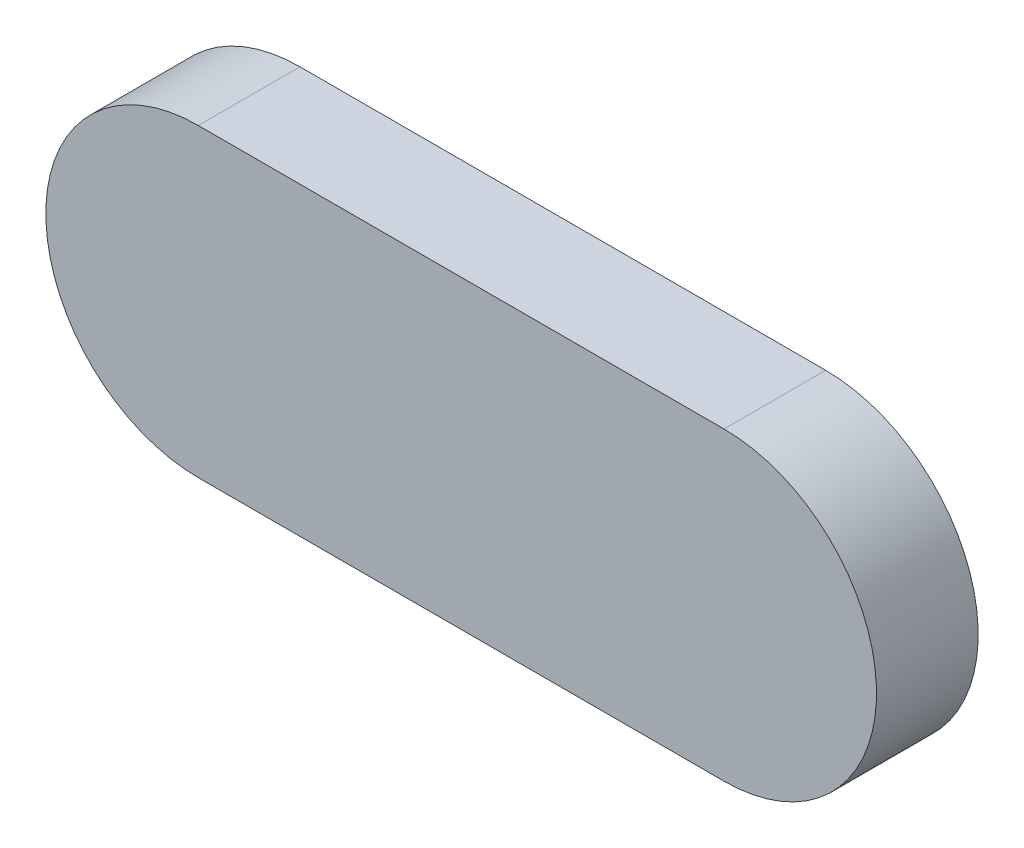
ISO-10303-21;
HEADER;
FILE_DESCRIPTION(('STEP AP214'),'2;1');
FILE_NAME('part.step','',(''),(''),'','','');
FILE_SCHEMA(('AUTOMOTIVE_DESIGN { 1 0 10303 214 1 1 1 1 }'));
ENDSEC;
DATA;
#1=APPLICATION_CONTEXT('core data for automotive mechanical design processes');
#2=APPLICATION_PROTOCOL_DEFINITION('international standard','automotive_design',2000,#1);
#3=PRODUCT_CONTEXT('',#1,'mechanical');
#4=PRODUCT('Part','Part','',(#3));
#5=PRODUCT_RELATED_PRODUCT_CATEGORY('part','',(#4));
#6=PRODUCT_DEFINITION_FORMATION('','',#4);
#7=PRODUCT_DEFINITION_CONTEXT('part definition',#1,'design');
#8=PRODUCT_DEFINITION('design','',#6,#7);
#9=PRODUCT_DEFINITION_SHAPE('','',#8);
#10=(LENGTH_UNIT() NAMED_UNIT(*) SI_UNIT(.MILLI.,.METRE.));
#11=(NAMED_UNIT(*) PLANE_ANGLE_UNIT() SI_UNIT($,.RADIAN.));
#12=(NAMED_UNIT(*) SI_UNIT($,.STERADIAN.) SOLID_ANGLE_UNIT());
#13=UNCERTAINTY_MEASURE_WITH_UNIT(LENGTH_MEASURE(1.E-05),#10,'distance_accuracy_value','');
#14=(GEOMETRIC_REPRESENTATION_CONTEXT(3) GLOBAL_UNCERTAINTY_ASSIGNED_CONTEXT((#13)) GLOBAL_UNIT_ASSIGNED_CONTEXT((#10,
#11,#12)) REPRESENTATION_CONTEXT('',''));
#15=CARTESIAN_POINT('',(0.,0.,0.));
#16=DIRECTION('',(0.,0.,1.));
#17=DIRECTION('',(1.,0.,0.));
#18=AXIS2_PLACEMENT_3D('',#15,#16,#17);
#19=CARTESIAN_POINT('',(-12.925,0.,2.5));
#20=DIRECTION('',(0.,0.,-1.));
#21=DIRECTION('',(-1.,0.,0.));
#22=AXIS2_PLACEMENT_3D('',#19,#20,#21);
#23=CYLINDRICAL_SURFACE('',#22,7.5);
#24=CARTESIAN_POINT('',(-12.925,0.,-2.5));
#25=DIRECTION('',(0.,0.,1.));
#26=DIRECTION('',(1.,0.,0.));
#27=AXIS2_PLACEMENT_3D('',#24,#25,#26);
#28=CIRCLE('',#27,7.5);
#29=CARTESIAN_POINT('',(-12.925,7.5,-2.5));
#30=VERTEX_POINT('',#29);
#31=CARTESIAN_POINT('',(-12.925,-7.5,-2.5));
#32=VERTEX_POINT('',#31);
#33=EDGE_CURVE('E107',#30,#32,#28,.T.);
#34=ORIENTED_EDGE('',*,*,#33,.T.);
#35=DIRECTION('',(0.,0.,-1.));
#36=VECTOR('',#35,1.);
#37=CARTESIAN_POINT('',(-12.925,-7.5,2.5));
#38=LINE('',#37,#36);
#39=CARTESIAN_POINT('',(-12.925,-7.5,2.5));
#40=VERTEX_POINT('',#39);
#41=EDGE_CURVE('E11',#40,#32,#38,.T.);
#42=ORIENTED_EDGE('',*,*,#41,.F.);
#43=CARTESIAN_POINT('',(-12.925,0.,2.5));
#44=DIRECTION('',(0.,0.,1.));
#45=DIRECTION('',(1.,0.,0.));
#46=AXIS2_PLACEMENT_3D('',#43,#44,#45);
#47=CIRCLE('',#46,7.5);
#48=CARTESIAN_POINT('',(-12.925,7.5,2.5));
#49=VERTEX_POINT('',#48);
#50=EDGE_CURVE('E91',#49,#40,#47,.T.);
#51=ORIENTED_EDGE('',*,*,#50,.F.);
#52=DIRECTION('',(0.,0.,-1.));
#53=VECTOR('',#52,1.);
#54=CARTESIAN_POINT('',(-12.925,7.5,2.5));
#55=LINE('',#54,#53);
#56=EDGE_CURVE('E103',#49,#30,#55,.T.);
#57=ORIENTED_EDGE('',*,*,#56,.T.);
#58=EDGE_LOOP('',(#34,#42,#51,#57));
#59=FACE_BOUND('',#58,.T.);
#60=ADVANCED_FACE('F39',(#59),#23,.T.);
#61=CARTESIAN_POINT('',(12.925,-7.5,2.5));
#62=DIRECTION('',(0.,1.,0.));
#63=DIRECTION('',(0.,0.,1.));
#64=AXIS2_PLACEMENT_3D('',#61,#62,#63);
#65=PLANE('',#64);
#66=DIRECTION('',(1.,0.,0.));
#67=VECTOR('',#66,1.);
#68=CARTESIAN_POINT('',(12.925,-7.5,-2.5));
#69=LINE('',#68,#67);
#70=CARTESIAN_POINT('',(12.925,-7.5,-2.5));
#71=VERTEX_POINT('',#70);
#72=EDGE_CURVE('E96',#32,#71,#69,.T.);
#73=ORIENTED_EDGE('',*,*,#72,.T.);
#74=DIRECTION('',(0.,0.,-1.));
#75=VECTOR('',#74,1.);
#76=CARTESIAN_POINT('',(12.925,-7.5,2.5));
#77=LINE('',#76,#75);
#78=CARTESIAN_POINT('',(12.925,-7.5,2.5));
#79=VERTEX_POINT('',#78);
#80=EDGE_CURVE('E48',#79,#71,#77,.T.);
#81=ORIENTED_EDGE('',*,*,#80,.F.);
#82=DIRECTION('',(1.,0.,0.));
#83=VECTOR('',#82,1.);
#84=CARTESIAN_POINT('',(12.925,-7.5,2.5));
#85=LINE('',#84,#83);
#86=EDGE_CURVE('E86',#40,#79,#85,.T.);
#87=ORIENTED_EDGE('',*,*,#86,.F.);
#88=ORIENTED_EDGE('',*,*,#41,.T.);
#89=EDGE_LOOP('',(#73,#81,#87,#88));
#90=FACE_BOUND('',#89,.T.);
#91=ADVANCED_FACE('F95',(#90),#65,.F.);
#92=CARTESIAN_POINT('',(12.925,0.,2.5));
#93=DIRECTION('',(0.,0.,-1.));
#94=DIRECTION('',(-1.,0.,0.));
#95=AXIS2_PLACEMENT_3D('',#92,#93,#94);
#96=CYLINDRICAL_SURFACE('',#95,7.5);
#97=CARTESIAN_POINT('',(12.925,0.,-2.5));
#98=DIRECTION('',(0.,0.,1.));
#99=DIRECTION('',(-1.,0.,0.));
#100=AXIS2_PLACEMENT_3D('',#97,#98,#99);
#101=CIRCLE('',#100,7.5);
#102=CARTESIAN_POINT('',(12.925,7.5,-2.5));
#103=VERTEX_POINT('',#102);
#104=EDGE_CURVE('E73',#71,#103,#101,.T.);
#105=ORIENTED_EDGE('',*,*,#104,.T.);
#106=DIRECTION('',(0.,0.,-1.));
#107=VECTOR('',#106,1.);
#108=CARTESIAN_POINT('',(12.925,7.5,2.5));
#109=LINE('',#108,#107);
#110=CARTESIAN_POINT('',(12.925,7.5,2.5));
#111=VERTEX_POINT('',#110);
#112=EDGE_CURVE('E98',#111,#103,#109,.T.);
#113=ORIENTED_EDGE('',*,*,#112,.F.);
#114=CARTESIAN_POINT('',(12.925,0.,2.5));
#115=DIRECTION('',(0.,0.,1.));
#116=DIRECTION('',(-1.,0.,0.));
#117=AXIS2_PLACEMENT_3D('',#114,#115,#116);
#118=CIRCLE('',#117,7.5);
#119=EDGE_CURVE('E89',#79,#111,#118,.T.);
#120=ORIENTED_EDGE('',*,*,#119,.F.);
#121=ORIENTED_EDGE('',*,*,#80,.T.);
#122=EDGE_LOOP('',(#105,#113,#120,#121));
#123=FACE_BOUND('',#122,.T.);
#124=ADVANCED_FACE('F99',(#123),#96,.T.);
#125=CARTESIAN_POINT('',(12.925,7.5,2.5));
#126=DIRECTION('',(0.,-1.,0.));
#127=DIRECTION('',(1.,0.,0.));
#128=AXIS2_PLACEMENT_3D('',#125,#126,#127);
#129=PLANE('',#128);
#130=DIRECTION('',(-1.,0.,0.));
#131=VECTOR('',#130,1.);
#132=CARTESIAN_POINT('',(12.925,7.5,-2.5));
#133=LINE('',#132,#131);
#134=EDGE_CURVE('E79',#103,#30,#133,.T.);
#135=ORIENTED_EDGE('',*,*,#134,.T.);
#136=ORIENTED_EDGE('',*,*,#56,.F.);
#137=DIRECTION('',(-1.,0.,0.));
#138=VECTOR('',#137,1.);
#139=CARTESIAN_POINT('',(12.925,7.5,2.5));
#140=LINE('',#139,#138);
#141=EDGE_CURVE('E56',#111,#49,#140,.T.);
#142=ORIENTED_EDGE('',*,*,#141,.F.);
#143=ORIENTED_EDGE('',*,*,#112,.T.);
#144=EDGE_LOOP('',(#135,#136,#142,#143));
#145=FACE_BOUND('',#144,.T.);
#146=ADVANCED_FACE('F120',(#145),#129,.F.);
#147=CARTESIAN_POINT('',(-12.925,0.,2.5));
#148=DIRECTION('',(0.,0.,1.));
#149=DIRECTION('',(1.,0.,0.));
#150=AXIS2_PLACEMENT_3D('',#147,#148,#149);
#151=PLANE('',#150);
#152=ORIENTED_EDGE('',*,*,#50,.T.);
#153=ORIENTED_EDGE('',*,*,#86,.T.);
#154=ORIENTED_EDGE('',*,*,#119,.T.);
#155=ORIENTED_EDGE('',*,*,#141,.T.);
#156=EDGE_LOOP('',(#152,#153,#154,#155));
#157=FACE_BOUND('',#156,.T.);
#158=ADVANCED_FACE('F87',(#157),#151,.T.);
#159=CARTESIAN_POINT('',(-12.925,0.,-2.5));
#160=DIRECTION('',(0.,0.,1.));
#161=DIRECTION('',(1.,0.,0.));
#162=AXIS2_PLACEMENT_3D('',#159,#160,#161);
#163=PLANE('',#162);
#164=ORIENTED_EDGE('',*,*,#33,.F.);
#165=ORIENTED_EDGE('',*,*,#134,.F.);
#166=ORIENTED_EDGE('',*,*,#104,.F.);
#167=ORIENTED_EDGE('',*,*,#72,.F.);
#168=EDGE_LOOP('',(#164,#165,#166,#167));
#169=FACE_BOUND('',#168,.T.);
#170=ADVANCED_FACE('F123',(#169),#163,.F.);
#171=CLOSED_SHELL('',(#60,#91,#124,#146,#158,#170));
#172=MANIFOLD_SOLID_BREP('B2',#171);
#173=ADVANCED_BREP_SHAPE_REPRESENTATION('',(#18,#172),#14);
#174=SHAPE_DEFINITION_REPRESENTATION(#9,#173);
ENDSEC;
END-ISO-10303-21;
